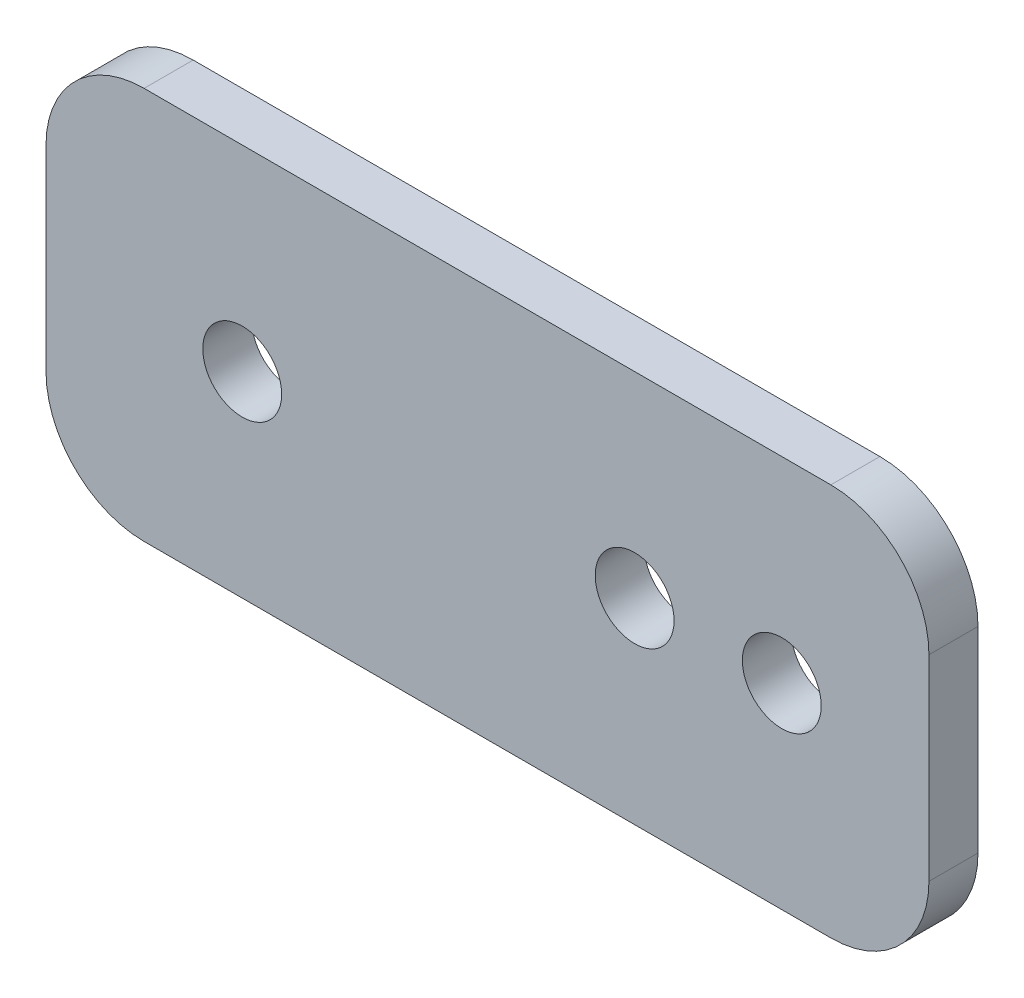
ISO-10303-21;
HEADER;
FILE_DESCRIPTION(('STEP AP214'),'2;1');
FILE_NAME('part.step','',(''),(''),'','','');
FILE_SCHEMA(('AUTOMOTIVE_DESIGN { 1 0 10303 214 1 1 1 1 }'));
ENDSEC;
DATA;
#1=APPLICATION_CONTEXT('core data for automotive mechanical design processes');
#2=APPLICATION_PROTOCOL_DEFINITION('international standard','automotive_design',2000,#1);
#3=PRODUCT_CONTEXT('',#1,'mechanical');
#4=PRODUCT('Part','Part','',(#3));
#5=PRODUCT_RELATED_PRODUCT_CATEGORY('part','',(#4));
#6=PRODUCT_DEFINITION_FORMATION('','',#4);
#7=PRODUCT_DEFINITION_CONTEXT('part definition',#1,'design');
#8=PRODUCT_DEFINITION('design','',#6,#7);
#9=PRODUCT_DEFINITION_SHAPE('','',#8);
#10=(LENGTH_UNIT() NAMED_UNIT(*) SI_UNIT(.MILLI.,.METRE.));
#11=(NAMED_UNIT(*) PLANE_ANGLE_UNIT() SI_UNIT($,.RADIAN.));
#12=(NAMED_UNIT(*) SI_UNIT($,.STERADIAN.) SOLID_ANGLE_UNIT());
#13=UNCERTAINTY_MEASURE_WITH_UNIT(LENGTH_MEASURE(1.E-05),#10,'distance_accuracy_value','');
#14=(GEOMETRIC_REPRESENTATION_CONTEXT(3) GLOBAL_UNCERTAINTY_ASSIGNED_CONTEXT((#13)) GLOBAL_UNIT_ASSIGNED_CONTEXT((#10,
#11,#12)) REPRESENTATION_CONTEXT('',''));
#15=CARTESIAN_POINT('',(0.,0.,0.));
#16=DIRECTION('',(0.,0.,1.));
#17=DIRECTION('',(1.,0.,0.));
#18=AXIS2_PLACEMENT_3D('',#15,#16,#17);
#19=CARTESIAN_POINT('',(0.,0.,3.175));
#20=DIRECTION('',(0.,0.,1.));
#21=DIRECTION('',(1.,0.,0.));
#22=AXIS2_PLACEMENT_3D('',#19,#20,#21);
#23=PLANE('',#22);
#24=CARTESIAN_POINT('',(38.1,-12.7,3.175));
#25=DIRECTION('',(0.,0.,1.));
#26=DIRECTION('',(1.,0.,0.));
#27=AXIS2_PLACEMENT_3D('',#24,#25,#26);
#28=CIRCLE('',#27,2.5527);
#29=CARTESIAN_POINT('',(40.6527,-12.7,3.175));
#30=VERTEX_POINT('',#29);
#31=EDGE_CURVE('E182',#30,#30,#28,.T.);
#32=ORIENTED_EDGE('',*,*,#31,.F.);
#33=EDGE_LOOP('',(#32));
#34=FACE_BOUND('',#33,.T.);
#35=DIRECTION('',(0.,-1.,0.));
#36=VECTOR('',#35,1.);
#37=CARTESIAN_POINT('',(0.,0.,3.175));
#38=LINE('',#37,#36);
#39=CARTESIAN_POINT('',(0.,-6.35,3.175));
#40=VERTEX_POINT('',#39);
#41=CARTESIAN_POINT('',(0.,-19.05,3.175));
#42=VERTEX_POINT('',#41);
#43=EDGE_CURVE('E139',#40,#42,#38,.T.);
#44=ORIENTED_EDGE('',*,*,#43,.T.);
#45=CARTESIAN_POINT('',(6.35,-19.05,3.175));
#46=DIRECTION('',(0.,0.,1.));
#47=DIRECTION('',(1.,0.,0.));
#48=AXIS2_PLACEMENT_3D('',#45,#46,#47);
#49=CIRCLE('',#48,6.35);
#50=CARTESIAN_POINT('',(6.35,-25.4,3.175));
#51=VERTEX_POINT('',#50);
#52=EDGE_CURVE('E154',#42,#51,#49,.T.);
#53=ORIENTED_EDGE('',*,*,#52,.T.);
#54=DIRECTION('',(1.,0.,0.));
#55=VECTOR('',#54,1.);
#56=CARTESIAN_POINT('',(0.,-25.4,3.175));
#57=LINE('',#56,#55);
#58=CARTESIAN_POINT('',(50.8,-25.4,3.175));
#59=VERTEX_POINT('',#58);
#60=EDGE_CURVE('E121',#51,#59,#57,.T.);
#61=ORIENTED_EDGE('',*,*,#60,.T.);
#62=CARTESIAN_POINT('',(50.8,-19.05,3.175));
#63=DIRECTION('',(0.,0.,1.));
#64=DIRECTION('',(1.,0.,0.));
#65=AXIS2_PLACEMENT_3D('',#62,#63,#64);
#66=CIRCLE('',#65,6.35);
#67=CARTESIAN_POINT('',(57.15,-19.05,3.175));
#68=VERTEX_POINT('',#67);
#69=EDGE_CURVE('E152',#59,#68,#66,.T.);
#70=ORIENTED_EDGE('',*,*,#69,.T.);
#71=DIRECTION('',(0.,1.,0.));
#72=VECTOR('',#71,1.);
#73=CARTESIAN_POINT('',(57.15,0.,3.175));
#74=LINE('',#73,#72);
#75=CARTESIAN_POINT('',(57.15,-6.35,3.175));
#76=VERTEX_POINT('',#75);
#77=EDGE_CURVE('E165',#68,#76,#74,.T.);
#78=ORIENTED_EDGE('',*,*,#77,.T.);
#79=CARTESIAN_POINT('',(50.8,-6.35,3.175));
#80=DIRECTION('',(0.,0.,1.));
#81=DIRECTION('',(1.,0.,0.));
#82=AXIS2_PLACEMENT_3D('',#79,#80,#81);
#83=CIRCLE('',#82,6.35);
#84=CARTESIAN_POINT('',(50.8,0.,3.175));
#85=VERTEX_POINT('',#84);
#86=EDGE_CURVE('E56',#76,#85,#83,.T.);
#87=ORIENTED_EDGE('',*,*,#86,.T.);
#88=DIRECTION('',(-1.,0.,0.));
#89=VECTOR('',#88,1.);
#90=CARTESIAN_POINT('',(0.,0.,3.175));
#91=LINE('',#90,#89);
#92=CARTESIAN_POINT('',(6.35,0.,3.175));
#93=VERTEX_POINT('',#92);
#94=EDGE_CURVE('E140',#85,#93,#91,.T.);
#95=ORIENTED_EDGE('',*,*,#94,.T.);
#96=CARTESIAN_POINT('',(6.35,-6.35,3.175));
#97=DIRECTION('',(0.,0.,1.));
#98=DIRECTION('',(1.,0.,0.));
#99=AXIS2_PLACEMENT_3D('',#96,#97,#98);
#100=CIRCLE('',#99,6.35);
#101=EDGE_CURVE('E149',#93,#40,#100,.T.);
#102=ORIENTED_EDGE('',*,*,#101,.T.);
#103=EDGE_LOOP('',(#44,#53,#61,#70,#78,#87,#95,#102));
#104=FACE_BOUND('',#103,.T.);
#105=CARTESIAN_POINT('',(12.7,-12.7,3.175));
#106=DIRECTION('',(0.,0.,1.));
#107=DIRECTION('',(1.,0.,0.));
#108=AXIS2_PLACEMENT_3D('',#105,#106,#107);
#109=CIRCLE('',#108,2.5527);
#110=CARTESIAN_POINT('',(15.2527,-12.7,3.175));
#111=VERTEX_POINT('',#110);
#112=EDGE_CURVE('E134',#111,#111,#109,.T.);
#113=ORIENTED_EDGE('',*,*,#112,.F.);
#114=EDGE_LOOP('',(#113));
#115=FACE_BOUND('',#114,.T.);
#116=CARTESIAN_POINT('',(47.625,-12.7,3.175));
#117=DIRECTION('',(0.,0.,1.));
#118=DIRECTION('',(1.,0.,0.));
#119=AXIS2_PLACEMENT_3D('',#116,#117,#118);
#120=CIRCLE('',#119,2.5527);
#121=CARTESIAN_POINT('',(50.1777,-12.7,3.175));
#122=VERTEX_POINT('',#121);
#123=EDGE_CURVE('E188',#122,#122,#120,.T.);
#124=ORIENTED_EDGE('',*,*,#123,.F.);
#125=EDGE_LOOP('',(#124));
#126=FACE_BOUND('',#125,.T.);
#127=ADVANCED_FACE('F35',(#34,#104,#115,#126),#23,.T.);
#128=CARTESIAN_POINT('',(0.,0.,0.));
#129=DIRECTION('',(0.,0.,1.));
#130=DIRECTION('',(1.,0.,0.));
#131=AXIS2_PLACEMENT_3D('',#128,#129,#130);
#132=PLANE('',#131);
#133=DIRECTION('',(1.,0.,0.));
#134=VECTOR('',#133,1.);
#135=CARTESIAN_POINT('',(0.,-25.4,0.));
#136=LINE('',#135,#134);
#137=CARTESIAN_POINT('',(6.35,-25.4,0.));
#138=VERTEX_POINT('',#137);
#139=CARTESIAN_POINT('',(50.8,-25.4,0.));
#140=VERTEX_POINT('',#139);
#141=EDGE_CURVE('E118',#138,#140,#136,.T.);
#142=ORIENTED_EDGE('',*,*,#141,.F.);
#143=CARTESIAN_POINT('',(6.35,-19.05,0.));
#144=DIRECTION('',(0.,0.,1.));
#145=DIRECTION('',(1.,0.,0.));
#146=AXIS2_PLACEMENT_3D('',#143,#144,#145);
#147=CIRCLE('',#146,6.35);
#148=CARTESIAN_POINT('',(0.,-19.05,0.));
#149=VERTEX_POINT('',#148);
#150=EDGE_CURVE('E101',#138,#149,#147,.F.);
#151=ORIENTED_EDGE('',*,*,#150,.T.);
#152=DIRECTION('',(0.,-1.,0.));
#153=VECTOR('',#152,1.);
#154=CARTESIAN_POINT('',(0.,0.,0.));
#155=LINE('',#154,#153);
#156=CARTESIAN_POINT('',(0.,-6.35,0.));
#157=VERTEX_POINT('',#156);
#158=EDGE_CURVE('E129',#157,#149,#155,.T.);
#159=ORIENTED_EDGE('',*,*,#158,.F.);
#160=CARTESIAN_POINT('',(6.35,-6.35,0.));
#161=DIRECTION('',(0.,0.,1.));
#162=DIRECTION('',(1.,0.,0.));
#163=AXIS2_PLACEMENT_3D('',#160,#161,#162);
#164=CIRCLE('',#163,6.35);
#165=CARTESIAN_POINT('',(6.35,0.,0.));
#166=VERTEX_POINT('',#165);
#167=EDGE_CURVE('E122',#157,#166,#164,.F.);
#168=ORIENTED_EDGE('',*,*,#167,.T.);
#169=DIRECTION('',(-1.,0.,0.));
#170=VECTOR('',#169,1.);
#171=CARTESIAN_POINT('',(0.,0.,0.));
#172=LINE('',#171,#170);
#173=CARTESIAN_POINT('',(50.8,0.,0.));
#174=VERTEX_POINT('',#173);
#175=EDGE_CURVE('E132',#174,#166,#172,.T.);
#176=ORIENTED_EDGE('',*,*,#175,.F.);
#177=CARTESIAN_POINT('',(50.8,-6.35,0.));
#178=DIRECTION('',(0.,0.,1.));
#179=DIRECTION('',(1.,0.,0.));
#180=AXIS2_PLACEMENT_3D('',#177,#178,#179);
#181=CIRCLE('',#180,6.35);
#182=CARTESIAN_POINT('',(57.15,-6.35,0.));
#183=VERTEX_POINT('',#182);
#184=EDGE_CURVE('E143',#174,#183,#181,.F.);
#185=ORIENTED_EDGE('',*,*,#184,.T.);
#186=DIRECTION('',(0.,1.,0.));
#187=VECTOR('',#186,1.);
#188=CARTESIAN_POINT('',(57.15,0.,0.));
#189=LINE('',#188,#187);
#190=CARTESIAN_POINT('',(57.15,-19.05,0.));
#191=VERTEX_POINT('',#190);
#192=EDGE_CURVE('E128',#191,#183,#189,.T.);
#193=ORIENTED_EDGE('',*,*,#192,.F.);
#194=CARTESIAN_POINT('',(50.8,-19.05,0.));
#195=DIRECTION('',(0.,0.,1.));
#196=DIRECTION('',(1.,0.,0.));
#197=AXIS2_PLACEMENT_3D('',#194,#195,#196);
#198=CIRCLE('',#197,6.35);
#199=EDGE_CURVE('E112',#191,#140,#198,.F.);
#200=ORIENTED_EDGE('',*,*,#199,.T.);
#201=EDGE_LOOP('',(#142,#151,#159,#168,#176,#185,#193,#200));
#202=FACE_BOUND('',#201,.T.);
#203=CARTESIAN_POINT('',(12.7,-12.7,0.));
#204=DIRECTION('',(0.,0.,1.));
#205=DIRECTION('',(1.,0.,0.));
#206=AXIS2_PLACEMENT_3D('',#203,#204,#205);
#207=CIRCLE('',#206,2.5527);
#208=CARTESIAN_POINT('',(15.2527,-12.7,0.));
#209=VERTEX_POINT('',#208);
#210=EDGE_CURVE('E179',#209,#209,#207,.T.);
#211=ORIENTED_EDGE('',*,*,#210,.T.);
#212=EDGE_LOOP('',(#211));
#213=FACE_BOUND('',#212,.T.);
#214=CARTESIAN_POINT('',(38.1,-12.7,0.));
#215=DIRECTION('',(0.,0.,1.));
#216=DIRECTION('',(1.,0.,0.));
#217=AXIS2_PLACEMENT_3D('',#214,#215,#216);
#218=CIRCLE('',#217,2.5527);
#219=CARTESIAN_POINT('',(40.6527,-12.7,0.));
#220=VERTEX_POINT('',#219);
#221=EDGE_CURVE('E185',#220,#220,#218,.T.);
#222=ORIENTED_EDGE('',*,*,#221,.T.);
#223=EDGE_LOOP('',(#222));
#224=FACE_BOUND('',#223,.T.);
#225=CARTESIAN_POINT('',(47.625,-12.7,0.));
#226=DIRECTION('',(0.,0.,1.));
#227=DIRECTION('',(1.,0.,0.));
#228=AXIS2_PLACEMENT_3D('',#225,#226,#227);
#229=CIRCLE('',#228,2.5527);
#230=CARTESIAN_POINT('',(50.1777,-12.7,0.));
#231=VERTEX_POINT('',#230);
#232=EDGE_CURVE('E191',#231,#231,#229,.T.);
#233=ORIENTED_EDGE('',*,*,#232,.T.);
#234=EDGE_LOOP('',(#233));
#235=FACE_BOUND('',#234,.T.);
#236=ADVANCED_FACE('F125',(#202,#213,#224,#235),#132,.F.);
#237=CARTESIAN_POINT('',(0.,0.,3.175));
#238=DIRECTION('',(1.,0.,0.));
#239=DIRECTION('',(0.,1.,0.));
#240=AXIS2_PLACEMENT_3D('',#237,#238,#239);
#241=PLANE('',#240);
#242=ORIENTED_EDGE('',*,*,#158,.T.);
#243=DIRECTION('',(0.,0.,-1.));
#244=VECTOR('',#243,1.);
#245=CARTESIAN_POINT('',(0.,-19.05,3.175));
#246=LINE('',#245,#244);
#247=EDGE_CURVE('E106',#149,#42,#246,.F.);
#248=ORIENTED_EDGE('',*,*,#247,.T.);
#249=ORIENTED_EDGE('',*,*,#43,.F.);
#250=DIRECTION('',(0.,0.,-1.));
#251=VECTOR('',#250,1.);
#252=CARTESIAN_POINT('',(0.,-6.35,3.175));
#253=LINE('',#252,#251);
#254=EDGE_CURVE('E111',#40,#157,#253,.T.);
#255=ORIENTED_EDGE('',*,*,#254,.T.);
#256=EDGE_LOOP('',(#242,#248,#249,#255));
#257=FACE_BOUND('',#256,.T.);
#258=ADVANCED_FACE('F206',(#257),#241,.F.);
#259=CARTESIAN_POINT('',(0.,-25.4,3.175));
#260=DIRECTION('',(0.,1.,0.));
#261=DIRECTION('',(0.,0.,1.));
#262=AXIS2_PLACEMENT_3D('',#259,#260,#261);
#263=PLANE('',#262);
#264=ORIENTED_EDGE('',*,*,#60,.F.);
#265=DIRECTION('',(0.,0.,-1.));
#266=VECTOR('',#265,1.);
#267=CARTESIAN_POINT('',(6.35,-25.4,3.175));
#268=LINE('',#267,#266);
#269=EDGE_CURVE('E105',#51,#138,#268,.T.);
#270=ORIENTED_EDGE('',*,*,#269,.T.);
#271=ORIENTED_EDGE('',*,*,#141,.T.);
#272=DIRECTION('',(0.,0.,-1.));
#273=VECTOR('',#272,1.);
#274=CARTESIAN_POINT('',(50.8,-25.4,3.175));
#275=LINE('',#274,#273);
#276=EDGE_CURVE('E123',#140,#59,#275,.F.);
#277=ORIENTED_EDGE('',*,*,#276,.T.);
#278=EDGE_LOOP('',(#264,#270,#271,#277));
#279=FACE_BOUND('',#278,.T.);
#280=ADVANCED_FACE('F117',(#279),#263,.F.);
#281=CARTESIAN_POINT('',(57.15,0.,3.175));
#282=DIRECTION('',(-1.,0.,0.));
#283=DIRECTION('',(0.,0.,1.));
#284=AXIS2_PLACEMENT_3D('',#281,#282,#283);
#285=PLANE('',#284);
#286=ORIENTED_EDGE('',*,*,#77,.F.);
#287=DIRECTION('',(0.,0.,-1.));
#288=VECTOR('',#287,1.);
#289=CARTESIAN_POINT('',(57.15,-19.05,3.175));
#290=LINE('',#289,#288);
#291=EDGE_CURVE('E158',#68,#191,#290,.T.);
#292=ORIENTED_EDGE('',*,*,#291,.T.);
#293=ORIENTED_EDGE('',*,*,#192,.T.);
#294=DIRECTION('',(0.,0.,-1.));
#295=VECTOR('',#294,1.);
#296=CARTESIAN_POINT('',(57.15,-6.35,3.175));
#297=LINE('',#296,#295);
#298=EDGE_CURVE('E156',#183,#76,#297,.F.);
#299=ORIENTED_EDGE('',*,*,#298,.T.);
#300=EDGE_LOOP('',(#286,#292,#293,#299));
#301=FACE_BOUND('',#300,.T.);
#302=ADVANCED_FACE('F163',(#301),#285,.F.);
#303=CARTESIAN_POINT('',(0.,0.,3.175));
#304=DIRECTION('',(0.,-1.,0.));
#305=DIRECTION('',(0.,0.,-1.));
#306=AXIS2_PLACEMENT_3D('',#303,#304,#305);
#307=PLANE('',#306);
#308=ORIENTED_EDGE('',*,*,#94,.F.);
#309=DIRECTION('',(0.,0.,-1.));
#310=VECTOR('',#309,1.);
#311=CARTESIAN_POINT('',(50.8,0.,3.175));
#312=LINE('',#311,#310);
#313=EDGE_CURVE('E11',#85,#174,#312,.T.);
#314=ORIENTED_EDGE('',*,*,#313,.T.);
#315=ORIENTED_EDGE('',*,*,#175,.T.);
#316=DIRECTION('',(0.,0.,-1.));
#317=VECTOR('',#316,1.);
#318=CARTESIAN_POINT('',(6.35,0.,3.175));
#319=LINE('',#318,#317);
#320=EDGE_CURVE('E43',#166,#93,#319,.F.);
#321=ORIENTED_EDGE('',*,*,#320,.T.);
#322=EDGE_LOOP('',(#308,#314,#315,#321));
#323=FACE_BOUND('',#322,.T.);
#324=ADVANCED_FACE('F172',(#323),#307,.F.);
#325=CARTESIAN_POINT('',(12.7,-12.7,3.175));
#326=DIRECTION('',(0.,0.,-1.));
#327=DIRECTION('',(-1.,0.,0.));
#328=AXIS2_PLACEMENT_3D('',#325,#326,#327);
#329=CYLINDRICAL_SURFACE('',#328,2.5527);
#330=ORIENTED_EDGE('',*,*,#112,.T.);
#331=EDGE_LOOP('',(#330));
#332=FACE_BOUND('',#331,.T.);
#333=ORIENTED_EDGE('',*,*,#210,.F.);
#334=EDGE_LOOP('',(#333));
#335=FACE_BOUND('',#334,.T.);
#336=ADVANCED_FACE('F210',(#332,#335),#329,.F.);
#337=CARTESIAN_POINT('',(38.1,-12.7,3.175));
#338=DIRECTION('',(0.,0.,-1.));
#339=DIRECTION('',(-1.,0.,0.));
#340=AXIS2_PLACEMENT_3D('',#337,#338,#339);
#341=CYLINDRICAL_SURFACE('',#340,2.5527);
#342=ORIENTED_EDGE('',*,*,#31,.T.);
#343=EDGE_LOOP('',(#342));
#344=FACE_BOUND('',#343,.T.);
#345=ORIENTED_EDGE('',*,*,#221,.F.);
#346=EDGE_LOOP('',(#345));
#347=FACE_BOUND('',#346,.T.);
#348=ADVANCED_FACE('F240',(#344,#347),#341,.F.);
#349=CARTESIAN_POINT('',(47.625,-12.7,3.175));
#350=DIRECTION('',(0.,0.,-1.));
#351=DIRECTION('',(-1.,0.,0.));
#352=AXIS2_PLACEMENT_3D('',#349,#350,#351);
#353=CYLINDRICAL_SURFACE('',#352,2.5527);
#354=ORIENTED_EDGE('',*,*,#123,.T.);
#355=EDGE_LOOP('',(#354));
#356=FACE_BOUND('',#355,.T.);
#357=ORIENTED_EDGE('',*,*,#232,.F.);
#358=EDGE_LOOP('',(#357));
#359=FACE_BOUND('',#358,.T.);
#360=ADVANCED_FACE('F197',(#356,#359),#353,.F.);
#361=CARTESIAN_POINT('',(6.35,-19.05,3.175));
#362=DIRECTION('',(0.,0.,-1.));
#363=DIRECTION('',(-1.,0.,0.));
#364=AXIS2_PLACEMENT_3D('',#361,#362,#363);
#365=CYLINDRICAL_SURFACE('',#364,6.35);
#366=ORIENTED_EDGE('',*,*,#52,.F.);
#367=ORIENTED_EDGE('',*,*,#247,.F.);
#368=ORIENTED_EDGE('',*,*,#150,.F.);
#369=ORIENTED_EDGE('',*,*,#269,.F.);
#370=EDGE_LOOP('',(#366,#367,#368,#369));
#371=FACE_BOUND('',#370,.T.);
#372=ADVANCED_FACE('F104',(#371),#365,.T.);
#373=CARTESIAN_POINT('',(50.8,-19.05,3.175));
#374=DIRECTION('',(0.,0.,-1.));
#375=DIRECTION('',(-1.,0.,0.));
#376=AXIS2_PLACEMENT_3D('',#373,#374,#375);
#377=CYLINDRICAL_SURFACE('',#376,6.35);
#378=ORIENTED_EDGE('',*,*,#69,.F.);
#379=ORIENTED_EDGE('',*,*,#276,.F.);
#380=ORIENTED_EDGE('',*,*,#199,.F.);
#381=ORIENTED_EDGE('',*,*,#291,.F.);
#382=EDGE_LOOP('',(#378,#379,#380,#381));
#383=FACE_BOUND('',#382,.T.);
#384=ADVANCED_FACE('F224',(#383),#377,.T.);
#385=CARTESIAN_POINT('',(50.8,-6.35,3.175));
#386=DIRECTION('',(0.,0.,-1.));
#387=DIRECTION('',(-1.,0.,0.));
#388=AXIS2_PLACEMENT_3D('',#385,#386,#387);
#389=CYLINDRICAL_SURFACE('',#388,6.35);
#390=ORIENTED_EDGE('',*,*,#86,.F.);
#391=ORIENTED_EDGE('',*,*,#298,.F.);
#392=ORIENTED_EDGE('',*,*,#184,.F.);
#393=ORIENTED_EDGE('',*,*,#313,.F.);
#394=EDGE_LOOP('',(#390,#391,#392,#393));
#395=FACE_BOUND('',#394,.T.);
#396=ADVANCED_FACE('F171',(#395),#389,.T.);
#397=CARTESIAN_POINT('',(6.35,-6.35,3.175));
#398=DIRECTION('',(0.,0.,-1.));
#399=DIRECTION('',(-1.,0.,0.));
#400=AXIS2_PLACEMENT_3D('',#397,#398,#399);
#401=CYLINDRICAL_SURFACE('',#400,6.35);
#402=ORIENTED_EDGE('',*,*,#101,.F.);
#403=ORIENTED_EDGE('',*,*,#320,.F.);
#404=ORIENTED_EDGE('',*,*,#167,.F.);
#405=ORIENTED_EDGE('',*,*,#254,.F.);
#406=EDGE_LOOP('',(#402,#403,#404,#405));
#407=FACE_BOUND('',#406,.T.);
#408=ADVANCED_FACE('F37',(#407),#401,.T.);
#409=CLOSED_SHELL('',(#127,#236,#258,#280,#302,#324,#336,#348,#360,#372,#384,#396,#408));
#410=MANIFOLD_SOLID_BREP('B2',#409);
#411=ADVANCED_BREP_SHAPE_REPRESENTATION('',(#18,#410),#14);
#412=SHAPE_DEFINITION_REPRESENTATION(#9,#411);
ENDSEC;
END-ISO-10303-21;
